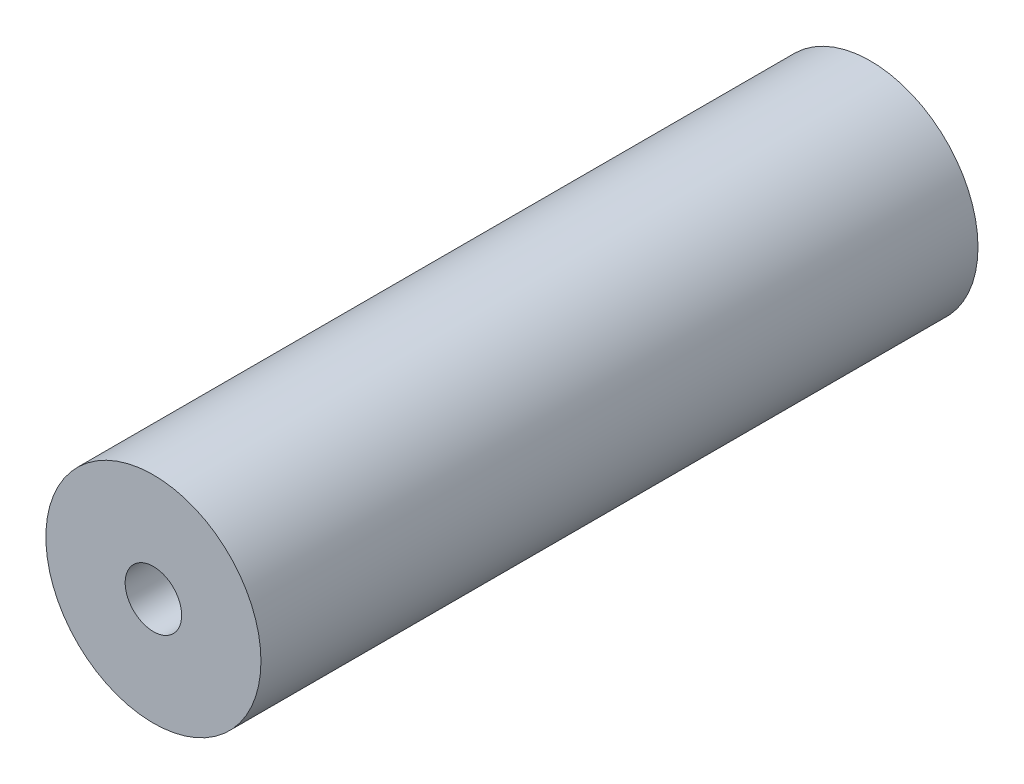
ISO-10303-21;
HEADER;
FILE_DESCRIPTION(('STEP AP214'),'2;1');
FILE_NAME('part.step','',(''),(''),'','','');
FILE_SCHEMA(('AUTOMOTIVE_DESIGN { 1 0 10303 214 1 1 1 1 }'));
ENDSEC;
DATA;
#1=APPLICATION_CONTEXT('core data for automotive mechanical design processes');
#2=APPLICATION_PROTOCOL_DEFINITION('international standard','automotive_design',2000,#1);
#3=PRODUCT_CONTEXT('',#1,'mechanical');
#4=PRODUCT('Part','Part','',(#3));
#5=PRODUCT_RELATED_PRODUCT_CATEGORY('part','',(#4));
#6=PRODUCT_DEFINITION_FORMATION('','',#4);
#7=PRODUCT_DEFINITION_CONTEXT('part definition',#1,'design');
#8=PRODUCT_DEFINITION('design','',#6,#7);
#9=PRODUCT_DEFINITION_SHAPE('','',#8);
#10=(LENGTH_UNIT() NAMED_UNIT(*) SI_UNIT(.MILLI.,.METRE.));
#11=(NAMED_UNIT(*) PLANE_ANGLE_UNIT() SI_UNIT($,.RADIAN.));
#12=(NAMED_UNIT(*) SI_UNIT($,.STERADIAN.) SOLID_ANGLE_UNIT());
#13=UNCERTAINTY_MEASURE_WITH_UNIT(LENGTH_MEASURE(1.E-05),#10,'distance_accuracy_value','');
#14=(GEOMETRIC_REPRESENTATION_CONTEXT(3) GLOBAL_UNCERTAINTY_ASSIGNED_CONTEXT((#13)) GLOBAL_UNIT_ASSIGNED_CONTEXT((#10,
#11,#12)) REPRESENTATION_CONTEXT('',''));
#15=CARTESIAN_POINT('',(0.,0.,0.));
#16=DIRECTION('',(0.,0.,1.));
#17=DIRECTION('',(1.,0.,0.));
#18=AXIS2_PLACEMENT_3D('',#15,#16,#17);
#19=CARTESIAN_POINT('',(0.,0.,31.75));
#20=DIRECTION('',(0.,0.,-1.));
#21=DIRECTION('',(-1.,0.,0.));
#22=AXIS2_PLACEMENT_3D('',#19,#20,#21);
#23=CYLINDRICAL_SURFACE('',#22,9.525);
#24=CARTESIAN_POINT('',(0.,0.,31.75));
#25=DIRECTION('',(0.,0.,1.));
#26=DIRECTION('',(1.,0.,0.));
#27=AXIS2_PLACEMENT_3D('',#24,#25,#26);
#28=CIRCLE('',#27,9.525);
#29=CARTESIAN_POINT('',(9.525,0.,31.75));
#30=VERTEX_POINT('',#29);
#31=EDGE_CURVE('E11',#30,#30,#28,.T.);
#32=ORIENTED_EDGE('',*,*,#31,.F.);
#33=EDGE_LOOP('',(#32));
#34=FACE_BOUND('',#33,.T.);
#35=CARTESIAN_POINT('',(0.,0.,-31.75));
#36=DIRECTION('',(0.,0.,1.));
#37=DIRECTION('',(1.,0.,0.));
#38=AXIS2_PLACEMENT_3D('',#35,#36,#37);
#39=CIRCLE('',#38,9.525);
#40=CARTESIAN_POINT('',(9.525,0.,-31.75));
#41=VERTEX_POINT('',#40);
#42=EDGE_CURVE('E41',#41,#41,#39,.T.);
#43=ORIENTED_EDGE('',*,*,#42,.T.);
#44=EDGE_LOOP('',(#43));
#45=FACE_BOUND('',#44,.T.);
#46=ADVANCED_FACE('F38',(#34,#45),#23,.T.);
#47=CARTESIAN_POINT('',(0.,0.,31.75));
#48=DIRECTION('',(0.,0.,1.));
#49=DIRECTION('',(1.,0.,0.));
#50=AXIS2_PLACEMENT_3D('',#47,#48,#49);
#51=PLANE('',#50);
#52=CARTESIAN_POINT('',(0.,0.,31.75));
#53=DIRECTION('',(0.,0.,1.));
#54=DIRECTION('',(1.,0.,0.));
#55=AXIS2_PLACEMENT_3D('',#52,#53,#54);
#56=CIRCLE('',#55,2.5);
#57=CARTESIAN_POINT('',(2.5,0.,31.75));
#58=VERTEX_POINT('',#57);
#59=EDGE_CURVE('E61',#58,#58,#56,.T.);
#60=ORIENTED_EDGE('',*,*,#59,.F.);
#61=EDGE_LOOP('',(#60));
#62=FACE_BOUND('',#61,.T.);
#63=ORIENTED_EDGE('',*,*,#31,.T.);
#64=EDGE_LOOP('',(#63));
#65=FACE_BOUND('',#64,.T.);
#66=ADVANCED_FACE('F80',(#62,#65),#51,.T.);
#67=CARTESIAN_POINT('',(0.,0.,-31.75));
#68=DIRECTION('',(0.,0.,1.));
#69=DIRECTION('',(1.,0.,0.));
#70=AXIS2_PLACEMENT_3D('',#67,#68,#69);
#71=PLANE('',#70);
#72=CARTESIAN_POINT('',(0.,0.,-31.75));
#73=DIRECTION('',(0.,0.,-1.));
#74=DIRECTION('',(-1.,0.,0.));
#75=AXIS2_PLACEMENT_3D('',#72,#73,#74);
#76=CIRCLE('',#75,2.5);
#77=CARTESIAN_POINT('',(-2.5,0.,-31.75));
#78=VERTEX_POINT('',#77);
#79=EDGE_CURVE('E62',#78,#78,#76,.T.);
#80=ORIENTED_EDGE('',*,*,#79,.F.);
#81=EDGE_LOOP('',(#80));
#82=FACE_BOUND('',#81,.T.);
#83=ORIENTED_EDGE('',*,*,#42,.F.);
#84=EDGE_LOOP('',(#83));
#85=FACE_BOUND('',#84,.T.);
#86=ADVANCED_FACE('F77',(#82,#85),#71,.F.);
#87=CARTESIAN_POINT('',(0.,0.,16.7386));
#88=DIRECTION('',(0.,0.,1.));
#89=DIRECTION('',(1.,0.,0.));
#90=AXIS2_PLACEMENT_3D('',#87,#88,#89);
#91=CONICAL_SURFACE('',#90,2.5,1.02974425867665);
#92=CARTESIAN_POINT('',(0.,0.,15.2364484524311));
#93=VERTEX_POINT('',#92);
#94=VERTEX_LOOP('',#93);
#95=FACE_BOUND('',#94,.T.);
#96=CARTESIAN_POINT('',(0.,0.,16.7386));
#97=DIRECTION('',(0.,0.,1.));
#98=DIRECTION('',(1.,0.,0.));
#99=AXIS2_PLACEMENT_3D('',#96,#97,#98);
#100=CIRCLE('',#99,2.5);
#101=CARTESIAN_POINT('',(2.5,0.,16.7386));
#102=VERTEX_POINT('',#101);
#103=EDGE_CURVE('E65',#102,#102,#100,.T.);
#104=ORIENTED_EDGE('',*,*,#103,.T.);
#105=EDGE_LOOP('',(#104));
#106=FACE_BOUND('',#105,.T.);
#107=ADVANCED_FACE('F79',(#95,#106),#91,.F.);
#108=CARTESIAN_POINT('',(0.,0.,31.75));
#109=DIRECTION('',(0.,0.,1.));
#110=DIRECTION('',(1.,0.,0.));
#111=AXIS2_PLACEMENT_3D('',#108,#109,#110);
#112=CYLINDRICAL_SURFACE('',#111,2.5);
#113=ORIENTED_EDGE('',*,*,#103,.F.);
#114=EDGE_LOOP('',(#113));
#115=FACE_BOUND('',#114,.T.);
#116=ORIENTED_EDGE('',*,*,#59,.T.);
#117=EDGE_LOOP('',(#116));
#118=FACE_BOUND('',#117,.T.);
#119=ADVANCED_FACE('F55',(#115,#118),#112,.F.);
#120=CARTESIAN_POINT('',(0.,0.,-16.7386));
#121=DIRECTION('',(0.,0.,-1.));
#122=DIRECTION('',(-1.,0.,0.));
#123=AXIS2_PLACEMENT_3D('',#120,#121,#122);
#124=CONICAL_SURFACE('',#123,2.5,1.02974425867665);
#125=CARTESIAN_POINT('',(0.,0.,-15.2364484524311));
#126=VERTEX_POINT('',#125);
#127=VERTEX_LOOP('',#126);
#128=FACE_BOUND('',#127,.T.);
#129=CARTESIAN_POINT('',(0.,0.,-16.7386));
#130=DIRECTION('',(0.,0.,-1.));
#131=DIRECTION('',(-1.,0.,0.));
#132=AXIS2_PLACEMENT_3D('',#129,#130,#131);
#133=CIRCLE('',#132,2.5);
#134=CARTESIAN_POINT('',(-2.5,0.,-16.7386));
#135=VERTEX_POINT('',#134);
#136=EDGE_CURVE('E59',#135,#135,#133,.T.);
#137=ORIENTED_EDGE('',*,*,#136,.T.);
#138=EDGE_LOOP('',(#137));
#139=FACE_BOUND('',#138,.T.);
#140=ADVANCED_FACE('F51',(#128,#139),#124,.F.);
#141=CARTESIAN_POINT('',(0.,0.,-31.75));
#142=DIRECTION('',(0.,0.,-1.));
#143=DIRECTION('',(-1.,0.,0.));
#144=AXIS2_PLACEMENT_3D('',#141,#142,#143);
#145=CYLINDRICAL_SURFACE('',#144,2.5);
#146=ORIENTED_EDGE('',*,*,#136,.F.);
#147=EDGE_LOOP('',(#146));
#148=FACE_BOUND('',#147,.T.);
#149=ORIENTED_EDGE('',*,*,#79,.T.);
#150=EDGE_LOOP('',(#149));
#151=FACE_BOUND('',#150,.T.);
#152=ADVANCED_FACE('F54',(#148,#151),#145,.F.);
#153=CLOSED_SHELL('',(#46,#66,#86,#107,#119,#140,#152));
#154=MANIFOLD_SOLID_BREP('B2',#153);
#155=ADVANCED_BREP_SHAPE_REPRESENTATION('',(#18,#154),#14);
#156=SHAPE_DEFINITION_REPRESENTATION(#9,#155);
ENDSEC;
END-ISO-10303-21;
